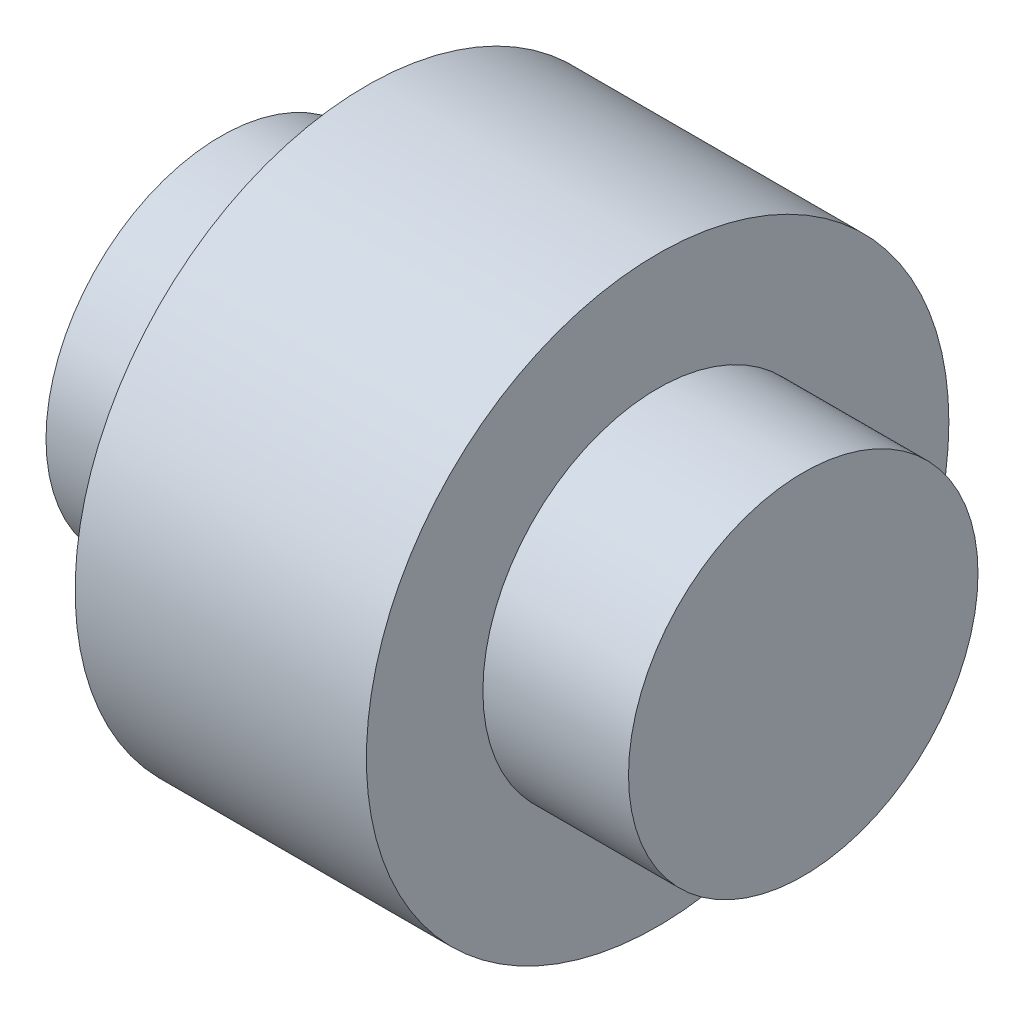
ISO-10303-21;
HEADER;
FILE_DESCRIPTION(('STEP AP214'),'2;1');
FILE_NAME('part.step','',(''),(''),'','','');
FILE_SCHEMA(('AUTOMOTIVE_DESIGN { 1 0 10303 214 1 1 1 1 }'));
ENDSEC;
DATA;
#1=APPLICATION_CONTEXT('core data for automotive mechanical design processes');
#2=APPLICATION_PROTOCOL_DEFINITION('international standard','automotive_design',2000,#1);
#3=PRODUCT_CONTEXT('',#1,'mechanical');
#4=PRODUCT('Part','Part','',(#3));
#5=PRODUCT_RELATED_PRODUCT_CATEGORY('part','',(#4));
#6=PRODUCT_DEFINITION_FORMATION('','',#4);
#7=PRODUCT_DEFINITION_CONTEXT('part definition',#1,'design');
#8=PRODUCT_DEFINITION('design','',#6,#7);
#9=PRODUCT_DEFINITION_SHAPE('','',#8);
#10=(LENGTH_UNIT() NAMED_UNIT(*) SI_UNIT(.MILLI.,.METRE.));
#11=(NAMED_UNIT(*) PLANE_ANGLE_UNIT() SI_UNIT($,.RADIAN.));
#12=(NAMED_UNIT(*) SI_UNIT($,.STERADIAN.) SOLID_ANGLE_UNIT());
#13=UNCERTAINTY_MEASURE_WITH_UNIT(LENGTH_MEASURE(1.E-05),#10,'distance_accuracy_value','');
#14=(GEOMETRIC_REPRESENTATION_CONTEXT(3) GLOBAL_UNCERTAINTY_ASSIGNED_CONTEXT((#13)) GLOBAL_UNIT_ASSIGNED_CONTEXT((#10,
#11,#12)) REPRESENTATION_CONTEXT('',''));
#15=CARTESIAN_POINT('',(0.,0.,0.));
#16=DIRECTION('',(0.,0.,1.));
#17=DIRECTION('',(1.,0.,0.));
#18=AXIS2_PLACEMENT_3D('',#15,#16,#17);
#19=CARTESIAN_POINT('',(-25.4,0.,0.));
#20=DIRECTION('',(1.,0.,0.));
#21=DIRECTION('',(0.,0.,-1.));
#22=AXIS2_PLACEMENT_3D('',#19,#20,#21);
#23=CYLINDRICAL_SURFACE('',#22,7.62);
#24=CARTESIAN_POINT('',(-6.35,0.,0.));
#25=DIRECTION('',(1.,0.,0.));
#26=DIRECTION('',(0.,0.,-1.));
#27=AXIS2_PLACEMENT_3D('',#24,#25,#26);
#28=CIRCLE('',#27,7.62);
#29=CARTESIAN_POINT('',(-6.35,0.,-7.62));
#30=VERTEX_POINT('',#29);
#31=EDGE_CURVE('E10',#30,#30,#28,.F.);
#32=ORIENTED_EDGE('',*,*,#31,.F.);
#33=EDGE_LOOP('',(#32));
#34=FACE_BOUND('',#33,.T.);
#35=CARTESIAN_POINT('',(0.,0.,0.));
#36=DIRECTION('',(1.,0.,0.));
#37=DIRECTION('',(0.,0.,-1.));
#38=AXIS2_PLACEMENT_3D('',#35,#36,#37);
#39=CIRCLE('',#38,7.62);
#40=CARTESIAN_POINT('',(0.,0.,-7.62));
#41=VERTEX_POINT('',#40);
#42=EDGE_CURVE('E49',#41,#41,#39,.T.);
#43=ORIENTED_EDGE('',*,*,#42,.F.);
#44=EDGE_LOOP('',(#43));
#45=FACE_BOUND('',#44,.T.);
#46=ADVANCED_FACE('F37',(#34,#45),#23,.T.);
#47=CARTESIAN_POINT('',(0.,0.,0.));
#48=DIRECTION('',(1.,0.,0.));
#49=DIRECTION('',(0.,0.,-1.));
#50=AXIS2_PLACEMENT_3D('',#47,#48,#49);
#51=PLANE('',#50);
#52=ORIENTED_EDGE('',*,*,#42,.T.);
#53=EDGE_LOOP('',(#52));
#54=FACE_BOUND('',#53,.T.);
#55=ADVANCED_FACE('F91',(#54),#51,.T.);
#56=CARTESIAN_POINT('',(-6.35,0.,0.));
#57=DIRECTION('',(-1.,0.,0.));
#58=DIRECTION('',(0.,0.,1.));
#59=AXIS2_PLACEMENT_3D('',#56,#57,#58);
#60=CYLINDRICAL_SURFACE('',#59,12.7);
#61=CARTESIAN_POINT('',(-6.35,0.,0.));
#62=DIRECTION('',(1.,0.,0.));
#63=DIRECTION('',(0.,0.,-1.));
#64=AXIS2_PLACEMENT_3D('',#61,#62,#63);
#65=CIRCLE('',#64,12.7);
#66=CARTESIAN_POINT('',(-6.35,0.,-12.7));
#67=VERTEX_POINT('',#66);
#68=EDGE_CURVE('E62',#67,#67,#65,.T.);
#69=ORIENTED_EDGE('',*,*,#68,.F.);
#70=EDGE_LOOP('',(#69));
#71=FACE_BOUND('',#70,.T.);
#72=CARTESIAN_POINT('',(-19.05,0.,0.));
#73=DIRECTION('',(1.,0.,0.));
#74=DIRECTION('',(0.,0.,-1.));
#75=AXIS2_PLACEMENT_3D('',#72,#73,#74);
#76=CIRCLE('',#75,12.7);
#77=CARTESIAN_POINT('',(-19.05,0.,-12.7));
#78=VERTEX_POINT('',#77);
#79=EDGE_CURVE('E58',#78,#78,#76,.T.);
#80=ORIENTED_EDGE('',*,*,#79,.T.);
#81=EDGE_LOOP('',(#80));
#82=FACE_BOUND('',#81,.T.);
#83=ADVANCED_FACE('F73',(#71,#82),#60,.T.);
#84=CARTESIAN_POINT('',(-6.35,0.,0.));
#85=DIRECTION('',(1.,0.,0.));
#86=DIRECTION('',(0.,0.,-1.));
#87=AXIS2_PLACEMENT_3D('',#84,#85,#86);
#88=PLANE('',#87);
#89=ORIENTED_EDGE('',*,*,#31,.T.);
#90=EDGE_LOOP('',(#89));
#91=FACE_BOUND('',#90,.T.);
#92=ORIENTED_EDGE('',*,*,#68,.T.);
#93=EDGE_LOOP('',(#92));
#94=FACE_BOUND('',#93,.T.);
#95=ADVANCED_FACE('F78',(#91,#94),#88,.T.);
#96=CARTESIAN_POINT('',(-19.05,0.,0.));
#97=DIRECTION('',(1.,0.,0.));
#98=DIRECTION('',(0.,0.,-1.));
#99=AXIS2_PLACEMENT_3D('',#96,#97,#98);
#100=PLANE('',#99);
#101=CARTESIAN_POINT('',(-19.05,0.,0.));
#102=DIRECTION('',(1.,0.,0.));
#103=DIRECTION('',(0.,0.,-1.));
#104=AXIS2_PLACEMENT_3D('',#101,#102,#103);
#105=CIRCLE('',#104,7.62);
#106=CARTESIAN_POINT('',(-19.05,0.,-7.62));
#107=VERTEX_POINT('',#106);
#108=EDGE_CURVE('E55',#107,#107,#105,.F.);
#109=ORIENTED_EDGE('',*,*,#108,.F.);
#110=EDGE_LOOP('',(#109));
#111=FACE_BOUND('',#110,.T.);
#112=ORIENTED_EDGE('',*,*,#79,.F.);
#113=EDGE_LOOP('',(#112));
#114=FACE_BOUND('',#113,.T.);
#115=ADVANCED_FACE('F75',(#111,#114),#100,.F.);
#116=CARTESIAN_POINT('',(-25.4,0.,0.));
#117=DIRECTION('',(1.,0.,0.));
#118=DIRECTION('',(0.,0.,-1.));
#119=AXIS2_PLACEMENT_3D('',#116,#117,#118);
#120=PLANE('',#119);
#121=CARTESIAN_POINT('',(-25.4,0.,0.));
#122=DIRECTION('',(1.,0.,0.));
#123=DIRECTION('',(0.,0.,-1.));
#124=AXIS2_PLACEMENT_3D('',#121,#122,#123);
#125=CIRCLE('',#124,7.62);
#126=CARTESIAN_POINT('',(-25.4,0.,-7.62));
#127=VERTEX_POINT('',#126);
#128=EDGE_CURVE('E44',#127,#127,#125,.T.);
#129=ORIENTED_EDGE('',*,*,#128,.F.);
#130=EDGE_LOOP('',(#129));
#131=FACE_BOUND('',#130,.T.);
#132=ADVANCED_FACE('F77',(#131),#120,.F.);
#133=ORIENTED_EDGE('',*,*,#128,.T.);
#134=EDGE_LOOP('',(#133));
#135=FACE_BOUND('',#134,.T.);
#136=ORIENTED_EDGE('',*,*,#108,.T.);
#137=EDGE_LOOP('',(#136));
#138=FACE_BOUND('',#137,.T.);
#139=ADVANCED_FACE('F85',(#135,#138),#23,.T.);
#140=CLOSED_SHELL('',(#46,#55,#83,#95,#115,#132,#139));
#141=MANIFOLD_SOLID_BREP('B2',#140);
#142=ADVANCED_BREP_SHAPE_REPRESENTATION('',(#18,#141),#14);
#143=SHAPE_DEFINITION_REPRESENTATION(#9,#142);
ENDSEC;
END-ISO-10303-21;
